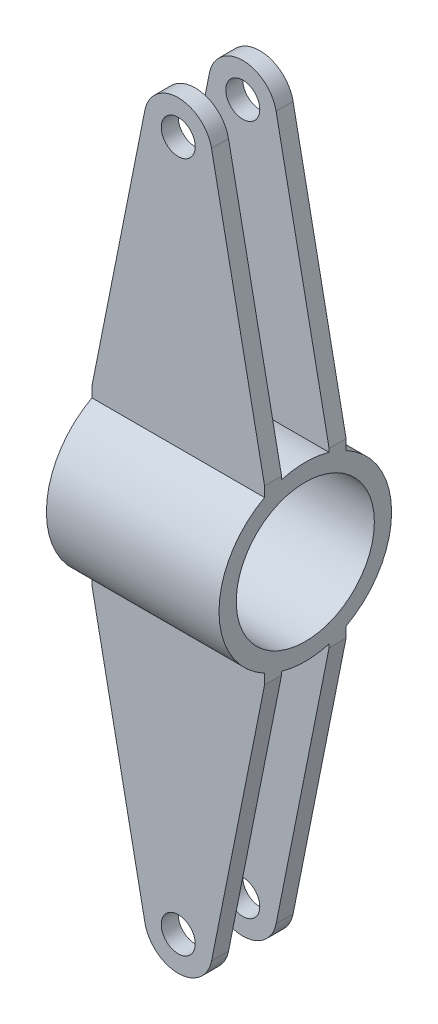
ISO-10303-21;
HEADER;
FILE_DESCRIPTION(('STEP AP214'),'2;1');
FILE_NAME('part.step','',(''),(''),'','','');
FILE_SCHEMA(('AUTOMOTIVE_DESIGN { 1 0 10303 214 1 1 1 1 }'));
ENDSEC;
DATA;
#1=APPLICATION_CONTEXT('core data for automotive mechanical design processes');
#2=APPLICATION_PROTOCOL_DEFINITION('international standard','automotive_design',2000,#1);
#3=PRODUCT_CONTEXT('',#1,'mechanical');
#4=PRODUCT('Part','Part','',(#3));
#5=PRODUCT_RELATED_PRODUCT_CATEGORY('part','',(#4));
#6=PRODUCT_DEFINITION_FORMATION('','',#4);
#7=PRODUCT_DEFINITION_CONTEXT('part definition',#1,'design');
#8=PRODUCT_DEFINITION('design','',#6,#7);
#9=PRODUCT_DEFINITION_SHAPE('','',#8);
#10=(LENGTH_UNIT() NAMED_UNIT(*) SI_UNIT(.MILLI.,.METRE.));
#11=(NAMED_UNIT(*) PLANE_ANGLE_UNIT() SI_UNIT($,.RADIAN.));
#12=(NAMED_UNIT(*) SI_UNIT($,.STERADIAN.) SOLID_ANGLE_UNIT());
#13=UNCERTAINTY_MEASURE_WITH_UNIT(LENGTH_MEASURE(1.E-05),#10,'distance_accuracy_value','');
#14=(GEOMETRIC_REPRESENTATION_CONTEXT(3) GLOBAL_UNCERTAINTY_ASSIGNED_CONTEXT((#13)) GLOBAL_UNIT_ASSIGNED_CONTEXT((#10,
#11,#12)) REPRESENTATION_CONTEXT('',''));
#15=CARTESIAN_POINT('',(0.,0.,0.));
#16=DIRECTION('',(0.,0.,1.));
#17=DIRECTION('',(1.,0.,0.));
#18=AXIS2_PLACEMENT_3D('',#15,#16,#17);
#19=CARTESIAN_POINT('',(25.4,0.,0.));
#20=DIRECTION('',(-1.,0.,0.));
#21=DIRECTION('',(0.,0.,1.));
#22=AXIS2_PLACEMENT_3D('',#19,#20,#21);
#23=CYLINDRICAL_SURFACE('',#22,25.4);
#24=DIRECTION('',(-1.,0.,0.));
#25=VECTOR('',#24,1.);
#26=CARTESIAN_POINT('',(25.4,22.3866031366976,12.));
#27=LINE('',#26,#25);
#28=CARTESIAN_POINT('',(25.4,22.3866031366976,12.));
#29=VERTEX_POINT('',#28);
#30=CARTESIAN_POINT('',(-25.4,22.3866031366976,12.));
#31=VERTEX_POINT('',#30);
#32=EDGE_CURVE('E269',#29,#31,#27,.T.);
#33=ORIENTED_EDGE('',*,*,#32,.T.);
#34=CARTESIAN_POINT('',(-25.4,0.,0.));
#35=DIRECTION('',(1.,0.,0.));
#36=DIRECTION('',(0.,0.,-1.));
#37=AXIS2_PLACEMENT_3D('',#34,#35,#36);
#38=CIRCLE('',#37,25.4);
#39=CARTESIAN_POINT('',(-25.4,-22.3866031366976,12.));
#40=VERTEX_POINT('',#39);
#41=EDGE_CURVE('E538',#31,#40,#38,.T.);
#42=ORIENTED_EDGE('',*,*,#41,.T.);
#43=DIRECTION('',(-1.,0.,0.));
#44=VECTOR('',#43,1.);
#45=CARTESIAN_POINT('',(25.4,-22.3866031366976,12.));
#46=LINE('',#45,#44);
#47=CARTESIAN_POINT('',(25.4,-22.3866031366976,12.));
#48=VERTEX_POINT('',#47);
#49=EDGE_CURVE('E320',#48,#40,#46,.T.);
#50=ORIENTED_EDGE('',*,*,#49,.F.);
#51=CARTESIAN_POINT('',(25.4,0.,0.));
#52=DIRECTION('',(1.,0.,0.));
#53=DIRECTION('',(0.,0.,-1.));
#54=AXIS2_PLACEMENT_3D('',#51,#52,#53);
#55=CIRCLE('',#54,25.4);
#56=EDGE_CURVE('E49',#29,#48,#55,.T.);
#57=ORIENTED_EDGE('',*,*,#56,.F.);
#58=EDGE_LOOP('',(#33,#42,#50,#57));
#59=FACE_BOUND('',#58,.T.);
#60=ADVANCED_FACE('F39',(#59),#23,.T.);
#61=DIRECTION('',(-1.,0.,0.));
#62=VECTOR('',#61,1.);
#63=CARTESIAN_POINT('',(25.4,24.416387939251,7.));
#64=LINE('',#63,#62);
#65=CARTESIAN_POINT('',(25.4,24.416387939251,7.));
#66=VERTEX_POINT('',#65);
#67=CARTESIAN_POINT('',(-25.4,24.416387939251,7.));
#68=VERTEX_POINT('',#67);
#69=EDGE_CURVE('E64',#66,#68,#64,.T.);
#70=ORIENTED_EDGE('',*,*,#69,.F.);
#71=CARTESIAN_POINT('',(25.4,24.416387939251,-7.));
#72=VERTEX_POINT('',#71);
#73=EDGE_CURVE('E11',#72,#66,#55,.T.);
#74=ORIENTED_EDGE('',*,*,#73,.F.);
#75=DIRECTION('',(-1.,0.,0.));
#76=VECTOR('',#75,1.);
#77=CARTESIAN_POINT('',(25.4,24.416387939251,-7.));
#78=LINE('',#77,#76);
#79=CARTESIAN_POINT('',(-25.4,24.416387939251,-7.));
#80=VERTEX_POINT('',#79);
#81=EDGE_CURVE('E469',#72,#80,#78,.T.);
#82=ORIENTED_EDGE('',*,*,#81,.T.);
#83=EDGE_CURVE('E43',#80,#68,#38,.T.);
#84=ORIENTED_EDGE('',*,*,#83,.T.);
#85=EDGE_LOOP('',(#70,#74,#82,#84));
#86=FACE_BOUND('',#85,.T.);
#87=ADVANCED_FACE('F501',(#86),#23,.T.);
#88=DIRECTION('',(-1.,0.,0.));
#89=VECTOR('',#88,1.);
#90=CARTESIAN_POINT('',(25.4,-24.416387939251,7.));
#91=LINE('',#90,#89);
#92=CARTESIAN_POINT('',(25.4,-24.416387939251,7.));
#93=VERTEX_POINT('',#92);
#94=CARTESIAN_POINT('',(-25.4,-24.416387939251,7.));
#95=VERTEX_POINT('',#94);
#96=EDGE_CURVE('E333',#93,#95,#91,.T.);
#97=ORIENTED_EDGE('',*,*,#96,.T.);
#98=CARTESIAN_POINT('',(-25.4,-24.416387939251,-7.));
#99=VERTEX_POINT('',#98);
#100=EDGE_CURVE('E535',#95,#99,#38,.T.);
#101=ORIENTED_EDGE('',*,*,#100,.T.);
#102=DIRECTION('',(-1.,0.,0.));
#103=VECTOR('',#102,1.);
#104=CARTESIAN_POINT('',(25.4,-24.416387939251,-7.));
#105=LINE('',#104,#103);
#106=CARTESIAN_POINT('',(25.4,-24.416387939251,-7.));
#107=VERTEX_POINT('',#106);
#108=EDGE_CURVE('E387',#107,#99,#105,.T.);
#109=ORIENTED_EDGE('',*,*,#108,.F.);
#110=EDGE_CURVE('E540',#93,#107,#55,.T.);
#111=ORIENTED_EDGE('',*,*,#110,.F.);
#112=EDGE_LOOP('',(#97,#101,#109,#111));
#113=FACE_BOUND('',#112,.T.);
#114=ADVANCED_FACE('F505',(#113),#23,.T.);
#115=DIRECTION('',(-1.,0.,0.));
#116=VECTOR('',#115,1.);
#117=CARTESIAN_POINT('',(25.4,-22.3866031366976,-12.));
#118=LINE('',#117,#116);
#119=CARTESIAN_POINT('',(25.4,-22.3866031366976,-12.));
#120=VERTEX_POINT('',#119);
#121=CARTESIAN_POINT('',(-25.4,-22.3866031366976,-12.));
#122=VERTEX_POINT('',#121);
#123=EDGE_CURVE('E401',#120,#122,#118,.T.);
#124=ORIENTED_EDGE('',*,*,#123,.T.);
#125=CARTESIAN_POINT('',(-25.4,22.3866031366976,-12.));
#126=VERTEX_POINT('',#125);
#127=EDGE_CURVE('E478',#122,#126,#38,.T.);
#128=ORIENTED_EDGE('',*,*,#127,.T.);
#129=DIRECTION('',(-1.,0.,0.));
#130=VECTOR('',#129,1.);
#131=CARTESIAN_POINT('',(25.4,22.3866031366976,-12.));
#132=LINE('',#131,#130);
#133=CARTESIAN_POINT('',(25.4,22.3866031366976,-12.));
#134=VERTEX_POINT('',#133);
#135=EDGE_CURVE('E455',#134,#126,#132,.T.);
#136=ORIENTED_EDGE('',*,*,#135,.F.);
#137=EDGE_CURVE('E50',#120,#134,#55,.T.);
#138=ORIENTED_EDGE('',*,*,#137,.F.);
#139=EDGE_LOOP('',(#124,#128,#136,#138));
#140=FACE_BOUND('',#139,.T.);
#141=ADVANCED_FACE('F41',(#140),#23,.T.);
#142=CARTESIAN_POINT('',(25.4,0.,0.));
#143=DIRECTION('',(1.,0.,0.));
#144=DIRECTION('',(0.,0.,-1.));
#145=AXIS2_PLACEMENT_3D('',#142,#143,#144);
#146=PLANE('',#145);
#147=ORIENTED_EDGE('',*,*,#73,.T.);
#148=DIRECTION('',(0.,1.,0.));
#149=VECTOR('',#148,1.);
#150=CARTESIAN_POINT('',(25.4,25.4,7.));
#151=LINE('',#150,#149);
#152=CARTESIAN_POINT('',(25.4,25.4,7.));
#153=VERTEX_POINT('',#152);
#154=EDGE_CURVE('E252',#66,#153,#151,.T.);
#155=ORIENTED_EDGE('',*,*,#154,.T.);
#156=DIRECTION('',(0.,0.,1.));
#157=VECTOR('',#156,1.);
#158=CARTESIAN_POINT('',(25.4,25.4,12.));
#159=LINE('',#158,#157);
#160=CARTESIAN_POINT('',(25.4,25.4,12.));
#161=VERTEX_POINT('',#160);
#162=EDGE_CURVE('E256',#153,#161,#159,.T.);
#163=ORIENTED_EDGE('',*,*,#162,.T.);
#164=DIRECTION('',(0.,-1.,0.));
#165=VECTOR('',#164,1.);
#166=CARTESIAN_POINT('',(25.4,25.4,12.));
#167=LINE('',#166,#165);
#168=EDGE_CURVE('E212',#161,#29,#167,.T.);
#169=ORIENTED_EDGE('',*,*,#168,.T.);
#170=ORIENTED_EDGE('',*,*,#56,.T.);
#171=DIRECTION('',(0.,-1.,0.));
#172=VECTOR('',#171,1.);
#173=CARTESIAN_POINT('',(25.4,-25.4,12.));
#174=LINE('',#173,#172);
#175=CARTESIAN_POINT('',(25.4,-25.4,12.));
#176=VERTEX_POINT('',#175);
#177=EDGE_CURVE('E307',#48,#176,#174,.T.);
#178=ORIENTED_EDGE('',*,*,#177,.T.);
#179=DIRECTION('',(0.,0.,-1.));
#180=VECTOR('',#179,1.);
#181=CARTESIAN_POINT('',(25.4,-25.4,12.));
#182=LINE('',#181,#180);
#183=CARTESIAN_POINT('',(25.4,-25.4,7.));
#184=VERTEX_POINT('',#183);
#185=EDGE_CURVE('E311',#176,#184,#182,.T.);
#186=ORIENTED_EDGE('',*,*,#185,.T.);
#187=DIRECTION('',(0.,1.,0.));
#188=VECTOR('',#187,1.);
#189=CARTESIAN_POINT('',(25.4,-25.4,7.));
#190=LINE('',#189,#188);
#191=EDGE_CURVE('E316',#184,#93,#190,.T.);
#192=ORIENTED_EDGE('',*,*,#191,.T.);
#193=ORIENTED_EDGE('',*,*,#110,.T.);
#194=DIRECTION('',(0.,-1.,0.));
#195=VECTOR('',#194,1.);
#196=CARTESIAN_POINT('',(25.4,-25.4,-7.));
#197=LINE('',#196,#195);
#198=CARTESIAN_POINT('',(25.4,-25.4,-7.));
#199=VERTEX_POINT('',#198);
#200=EDGE_CURVE('E380',#107,#199,#197,.T.);
#201=ORIENTED_EDGE('',*,*,#200,.T.);
#202=DIRECTION('',(0.,0.,-1.));
#203=VECTOR('',#202,1.);
#204=CARTESIAN_POINT('',(25.4,-25.4,-12.));
#205=LINE('',#204,#203);
#206=CARTESIAN_POINT('',(25.4,-25.4,-12.));
#207=VERTEX_POINT('',#206);
#208=EDGE_CURVE('E384',#199,#207,#205,.T.);
#209=ORIENTED_EDGE('',*,*,#208,.T.);
#210=DIRECTION('',(0.,1.,0.));
#211=VECTOR('',#210,1.);
#212=CARTESIAN_POINT('',(25.4,-25.4,-12.));
#213=LINE('',#212,#211);
#214=EDGE_CURVE('E376',#207,#120,#213,.T.);
#215=ORIENTED_EDGE('',*,*,#214,.T.);
#216=ORIENTED_EDGE('',*,*,#137,.T.);
#217=DIRECTION('',(0.,1.,0.));
#218=VECTOR('',#217,1.);
#219=CARTESIAN_POINT('',(25.4,25.4,-12.));
#220=LINE('',#219,#218);
#221=CARTESIAN_POINT('',(25.4,25.4,-12.));
#222=VERTEX_POINT('',#221);
#223=EDGE_CURVE('E442',#134,#222,#220,.T.);
#224=ORIENTED_EDGE('',*,*,#223,.T.);
#225=DIRECTION('',(0.,0.,1.));
#226=VECTOR('',#225,1.);
#227=CARTESIAN_POINT('',(25.4,25.4,-12.));
#228=LINE('',#227,#226);
#229=CARTESIAN_POINT('',(25.4,25.4,-7.));
#230=VERTEX_POINT('',#229);
#231=EDGE_CURVE('E446',#222,#230,#228,.T.);
#232=ORIENTED_EDGE('',*,*,#231,.T.);
#233=DIRECTION('',(0.,-1.,0.));
#234=VECTOR('',#233,1.);
#235=CARTESIAN_POINT('',(25.4,25.4,-7.));
#236=LINE('',#235,#234);
#237=EDGE_CURVE('E451',#230,#72,#236,.T.);
#238=ORIENTED_EDGE('',*,*,#237,.T.);
#239=EDGE_LOOP('',(#147,#155,#163,#169,#170,#178,#186,#192,#193,#201,#209,#215,#216,#224,#232,#238));
#240=FACE_BOUND('',#239,.T.);
#241=CARTESIAN_POINT('',(25.4,0.,0.));
#242=DIRECTION('',(1.,0.,0.));
#243=DIRECTION('',(0.,0.,-1.));
#244=AXIS2_PLACEMENT_3D('',#241,#242,#243);
#245=CIRCLE('',#244,20.32);
#246=CARTESIAN_POINT('',(25.4,0.,-20.32));
#247=VERTEX_POINT('',#246);
#248=EDGE_CURVE('E474',#247,#247,#245,.T.);
#249=ORIENTED_EDGE('',*,*,#248,.F.);
#250=EDGE_LOOP('',(#249));
#251=FACE_BOUND('',#250,.T.);
#252=ADVANCED_FACE('F497',(#240,#251),#146,.T.);
#253=CARTESIAN_POINT('',(-25.4,0.,0.));
#254=DIRECTION('',(1.,0.,0.));
#255=DIRECTION('',(0.,0.,-1.));
#256=AXIS2_PLACEMENT_3D('',#253,#254,#255);
#257=PLANE('',#256);
#258=ORIENTED_EDGE('',*,*,#83,.F.);
#259=DIRECTION('',(0.,-1.,0.));
#260=VECTOR('',#259,1.);
#261=CARTESIAN_POINT('',(-25.4,25.4,-7.));
#262=LINE('',#261,#260);
#263=CARTESIAN_POINT('',(-25.4,25.4,-7.));
#264=VERTEX_POINT('',#263);
#265=EDGE_CURVE('E447',#264,#80,#262,.T.);
#266=ORIENTED_EDGE('',*,*,#265,.F.);
#267=DIRECTION('',(0.,0.,1.));
#268=VECTOR('',#267,1.);
#269=CARTESIAN_POINT('',(-25.4,25.4,-12.));
#270=LINE('',#269,#268);
#271=CARTESIAN_POINT('',(-25.4,25.4,-12.));
#272=VERTEX_POINT('',#271);
#273=EDGE_CURVE('E459',#272,#264,#270,.T.);
#274=ORIENTED_EDGE('',*,*,#273,.F.);
#275=DIRECTION('',(0.,1.,0.));
#276=VECTOR('',#275,1.);
#277=CARTESIAN_POINT('',(-25.4,25.4,-12.));
#278=LINE('',#277,#276);
#279=EDGE_CURVE('E439',#126,#272,#278,.T.);
#280=ORIENTED_EDGE('',*,*,#279,.F.);
#281=ORIENTED_EDGE('',*,*,#127,.F.);
#282=DIRECTION('',(0.,1.,0.));
#283=VECTOR('',#282,1.);
#284=CARTESIAN_POINT('',(-25.4,-25.4,-12.));
#285=LINE('',#284,#283);
#286=CARTESIAN_POINT('',(-25.4,-25.4,-12.));
#287=VERTEX_POINT('',#286);
#288=EDGE_CURVE('E373',#287,#122,#285,.T.);
#289=ORIENTED_EDGE('',*,*,#288,.F.);
#290=DIRECTION('',(0.,0.,-1.));
#291=VECTOR('',#290,1.);
#292=CARTESIAN_POINT('',(-25.4,-25.4,-12.));
#293=LINE('',#292,#291);
#294=CARTESIAN_POINT('',(-25.4,-25.4,-7.));
#295=VERTEX_POINT('',#294);
#296=EDGE_CURVE('E381',#295,#287,#293,.T.);
#297=ORIENTED_EDGE('',*,*,#296,.F.);
#298=DIRECTION('',(0.,-1.,0.));
#299=VECTOR('',#298,1.);
#300=CARTESIAN_POINT('',(-25.4,-25.4,-7.));
#301=LINE('',#300,#299);
#302=EDGE_CURVE('E391',#99,#295,#301,.T.);
#303=ORIENTED_EDGE('',*,*,#302,.F.);
#304=ORIENTED_EDGE('',*,*,#100,.F.);
#305=DIRECTION('',(0.,1.,0.));
#306=VECTOR('',#305,1.);
#307=CARTESIAN_POINT('',(-25.4,-25.4,7.));
#308=LINE('',#307,#306);
#309=CARTESIAN_POINT('',(-25.4,-25.4,7.));
#310=VERTEX_POINT('',#309);
#311=EDGE_CURVE('E312',#310,#95,#308,.T.);
#312=ORIENTED_EDGE('',*,*,#311,.F.);
#313=DIRECTION('',(0.,0.,-1.));
#314=VECTOR('',#313,1.);
#315=CARTESIAN_POINT('',(-25.4,-25.4,12.));
#316=LINE('',#315,#314);
#317=CARTESIAN_POINT('',(-25.4,-25.4,12.));
#318=VERTEX_POINT('',#317);
#319=EDGE_CURVE('E324',#318,#310,#316,.T.);
#320=ORIENTED_EDGE('',*,*,#319,.F.);
#321=DIRECTION('',(0.,-1.,0.));
#322=VECTOR('',#321,1.);
#323=CARTESIAN_POINT('',(-25.4,-25.4,12.));
#324=LINE('',#323,#322);
#325=EDGE_CURVE('E306',#40,#318,#324,.T.);
#326=ORIENTED_EDGE('',*,*,#325,.F.);
#327=ORIENTED_EDGE('',*,*,#41,.F.);
#328=DIRECTION('',(0.,-1.,0.));
#329=VECTOR('',#328,1.);
#330=CARTESIAN_POINT('',(-25.4,25.4,12.));
#331=LINE('',#330,#329);
#332=CARTESIAN_POINT('',(-25.4,25.4,12.));
#333=VERTEX_POINT('',#332);
#334=EDGE_CURVE('E226',#333,#31,#331,.T.);
#335=ORIENTED_EDGE('',*,*,#334,.F.);
#336=DIRECTION('',(0.,0.,1.));
#337=VECTOR('',#336,1.);
#338=CARTESIAN_POINT('',(-25.4,25.4,12.));
#339=LINE('',#338,#337);
#340=CARTESIAN_POINT('',(-25.4,25.4,7.));
#341=VERTEX_POINT('',#340);
#342=EDGE_CURVE('E253',#341,#333,#339,.T.);
#343=ORIENTED_EDGE('',*,*,#342,.F.);
#344=DIRECTION('',(0.,1.,0.));
#345=VECTOR('',#344,1.);
#346=CARTESIAN_POINT('',(-25.4,25.4,7.));
#347=LINE('',#346,#345);
#348=EDGE_CURVE('E261',#68,#341,#347,.T.);
#349=ORIENTED_EDGE('',*,*,#348,.F.);
#350=EDGE_LOOP('',(#258,#266,#274,#280,#281,#289,#297,#303,#304,#312,#320,#326,#327,#335,#343,#349));
#351=FACE_BOUND('',#350,.T.);
#352=CARTESIAN_POINT('',(-25.4,0.,0.));
#353=DIRECTION('',(1.,0.,0.));
#354=DIRECTION('',(0.,0.,-1.));
#355=AXIS2_PLACEMENT_3D('',#352,#353,#354);
#356=CIRCLE('',#355,20.32);
#357=CARTESIAN_POINT('',(-25.4,0.,-20.32));
#358=VERTEX_POINT('',#357);
#359=EDGE_CURVE('E473',#358,#358,#356,.T.);
#360=ORIENTED_EDGE('',*,*,#359,.T.);
#361=EDGE_LOOP('',(#360));
#362=FACE_BOUND('',#361,.T.);
#363=ADVANCED_FACE('F483',(#351,#362),#257,.F.);
#364=CARTESIAN_POINT('',(25.4,0.,0.));
#365=DIRECTION('',(-1.,0.,0.));
#366=DIRECTION('',(0.,0.,1.));
#367=AXIS2_PLACEMENT_3D('',#364,#365,#366);
#368=CYLINDRICAL_SURFACE('',#367,20.32);
#369=ORIENTED_EDGE('',*,*,#248,.T.);
#370=EDGE_LOOP('',(#369));
#371=FACE_BOUND('',#370,.T.);
#372=ORIENTED_EDGE('',*,*,#359,.F.);
#373=EDGE_LOOP('',(#372));
#374=FACE_BOUND('',#373,.T.);
#375=ADVANCED_FACE('F485',(#371,#374),#368,.F.);
#376=CARTESIAN_POINT('',(25.4,25.4,-12.));
#377=DIRECTION('',(0.,0.,1.));
#378=DIRECTION('',(1.,0.,0.));
#379=AXIS2_PLACEMENT_3D('',#376,#377,#378);
#380=PLANE('',#379);
#381=ORIENTED_EDGE('',*,*,#279,.T.);
#382=DIRECTION('',(-0.195657188634298,-0.980672353304468,0.));
#383=VECTOR('',#382,1.);
#384=CARTESIAN_POINT('',(-25.4,25.4,-12.));
#385=LINE('',#384,#383);
#386=CARTESIAN_POINT('',(-9.80672353304468,103.556571886343,-12.));
#387=VERTEX_POINT('',#386);
#388=EDGE_CURVE('E423',#387,#272,#385,.T.);
#389=ORIENTED_EDGE('',*,*,#388,.F.);
#390=CARTESIAN_POINT('',(0.,101.6,-12.));
#391=DIRECTION('',(0.,0.,1.));
#392=DIRECTION('',(1.,0.,0.));
#393=AXIS2_PLACEMENT_3D('',#390,#391,#392);
#394=CIRCLE('',#393,10.);
#395=CARTESIAN_POINT('',(9.80672353304468,103.556571886343,-12.));
#396=VERTEX_POINT('',#395);
#397=EDGE_CURVE('E418',#396,#387,#394,.T.);
#398=ORIENTED_EDGE('',*,*,#397,.F.);
#399=DIRECTION('',(-0.195657188634298,0.980672353304468,0.));
#400=VECTOR('',#399,1.);
#401=CARTESIAN_POINT('',(25.4,25.4,-12.));
#402=LINE('',#401,#400);
#403=EDGE_CURVE('E414',#222,#396,#402,.T.);
#404=ORIENTED_EDGE('',*,*,#403,.F.);
#405=ORIENTED_EDGE('',*,*,#223,.F.);
#406=ORIENTED_EDGE('',*,*,#135,.T.);
#407=EDGE_LOOP('',(#381,#389,#398,#404,#405,#406));
#408=FACE_BOUND('',#407,.T.);
#409=CARTESIAN_POINT('',(0.,101.6,-12.));
#410=DIRECTION('',(0.,0.,1.));
#411=DIRECTION('',(1.,0.,0.));
#412=AXIS2_PLACEMENT_3D('',#409,#410,#411);
#413=CIRCLE('',#412,5.);
#414=CARTESIAN_POINT('',(5.,101.6,-12.));
#415=VERTEX_POINT('',#414);
#416=EDGE_CURVE('E406',#415,#415,#413,.T.);
#417=ORIENTED_EDGE('',*,*,#416,.T.);
#418=EDGE_LOOP('',(#417));
#419=FACE_BOUND('',#418,.T.);
#420=ADVANCED_FACE('F487',(#408,#419),#380,.F.);
#421=CARTESIAN_POINT('',(25.4,25.4,-7.));
#422=DIRECTION('',(0.,0.,-1.));
#423=DIRECTION('',(-1.,0.,0.));
#424=AXIS2_PLACEMENT_3D('',#421,#422,#423);
#425=PLANE('',#424);
#426=ORIENTED_EDGE('',*,*,#265,.T.);
#427=ORIENTED_EDGE('',*,*,#81,.F.);
#428=ORIENTED_EDGE('',*,*,#237,.F.);
#429=DIRECTION('',(-0.195657188634298,0.980672353304468,0.));
#430=VECTOR('',#429,1.);
#431=CARTESIAN_POINT('',(25.4,25.4,-7.));
#432=LINE('',#431,#430);
#433=CARTESIAN_POINT('',(9.80672353304468,103.556571886343,-7.));
#434=VERTEX_POINT('',#433);
#435=EDGE_CURVE('E410',#230,#434,#432,.T.);
#436=ORIENTED_EDGE('',*,*,#435,.T.);
#437=CARTESIAN_POINT('',(0.,101.6,-7.));
#438=DIRECTION('',(0.,0.,1.));
#439=DIRECTION('',(1.,0.,0.));
#440=AXIS2_PLACEMENT_3D('',#437,#438,#439);
#441=CIRCLE('',#440,10.);
#442=CARTESIAN_POINT('',(-9.80672353304468,103.556571886343,-7.));
#443=VERTEX_POINT('',#442);
#444=EDGE_CURVE('E430',#434,#443,#441,.T.);
#445=ORIENTED_EDGE('',*,*,#444,.T.);
#446=DIRECTION('',(-0.195657188634298,-0.980672353304468,0.));
#447=VECTOR('',#446,1.);
#448=CARTESIAN_POINT('',(-25.4,25.4,-7.));
#449=LINE('',#448,#447);
#450=EDGE_CURVE('E419',#443,#264,#449,.T.);
#451=ORIENTED_EDGE('',*,*,#450,.T.);
#452=EDGE_LOOP('',(#426,#427,#428,#436,#445,#451));
#453=FACE_BOUND('',#452,.T.);
#454=CARTESIAN_POINT('',(0.,101.6,-7.));
#455=DIRECTION('',(0.,0.,1.));
#456=DIRECTION('',(1.,0.,0.));
#457=AXIS2_PLACEMENT_3D('',#454,#455,#456);
#458=CIRCLE('',#457,5.);
#459=CARTESIAN_POINT('',(5.,101.6,-7.));
#460=VERTEX_POINT('',#459);
#461=EDGE_CURVE('E405',#460,#460,#458,.T.);
#462=ORIENTED_EDGE('',*,*,#461,.F.);
#463=EDGE_LOOP('',(#462));
#464=FACE_BOUND('',#463,.T.);
#465=ADVANCED_FACE('F494',(#453,#464),#425,.F.);
#466=CARTESIAN_POINT('',(-25.4,25.4,-12.));
#467=DIRECTION('',(-0.980672353304468,0.195657188634298,0.));
#468=DIRECTION('',(-0.195657188634298,-0.980672353304468,0.));
#469=AXIS2_PLACEMENT_3D('',#466,#467,#468);
#470=PLANE('',#469);
#471=ORIENTED_EDGE('',*,*,#450,.F.);
#472=DIRECTION('',(0.,0.,1.));
#473=VECTOR('',#472,1.);
#474=CARTESIAN_POINT('',(-9.80672353304468,103.556571886343,-12.));
#475=LINE('',#474,#473);
#476=EDGE_CURVE('E436',#387,#443,#475,.T.);
#477=ORIENTED_EDGE('',*,*,#476,.F.);
#478=ORIENTED_EDGE('',*,*,#388,.T.);
#479=ORIENTED_EDGE('',*,*,#273,.T.);
#480=EDGE_LOOP('',(#471,#477,#478,#479));
#481=FACE_BOUND('',#480,.T.);
#482=ADVANCED_FACE('F634',(#481),#470,.T.);
#483=CARTESIAN_POINT('',(0.,101.6,-12.));
#484=DIRECTION('',(0.,0.,1.));
#485=DIRECTION('',(1.,0.,0.));
#486=AXIS2_PLACEMENT_3D('',#483,#484,#485);
#487=CYLINDRICAL_SURFACE('',#486,10.);
#488=ORIENTED_EDGE('',*,*,#444,.F.);
#489=DIRECTION('',(0.,0.,1.));
#490=VECTOR('',#489,1.);
#491=CARTESIAN_POINT('',(9.80672353304468,103.556571886343,-12.));
#492=LINE('',#491,#490);
#493=EDGE_CURVE('E426',#396,#434,#492,.T.);
#494=ORIENTED_EDGE('',*,*,#493,.F.);
#495=ORIENTED_EDGE('',*,*,#397,.T.);
#496=ORIENTED_EDGE('',*,*,#476,.T.);
#497=EDGE_LOOP('',(#488,#494,#495,#496));
#498=FACE_BOUND('',#497,.T.);
#499=ADVANCED_FACE('F637',(#498),#487,.T.);
#500=CARTESIAN_POINT('',(25.4,25.4,-12.));
#501=DIRECTION('',(0.980672353304468,0.195657188634298,0.));
#502=DIRECTION('',(-0.195657188634298,0.980672353304468,0.));
#503=AXIS2_PLACEMENT_3D('',#500,#501,#502);
#504=PLANE('',#503);
#505=ORIENTED_EDGE('',*,*,#435,.F.);
#506=ORIENTED_EDGE('',*,*,#231,.F.);
#507=ORIENTED_EDGE('',*,*,#403,.T.);
#508=ORIENTED_EDGE('',*,*,#493,.T.);
#509=EDGE_LOOP('',(#505,#506,#507,#508));
#510=FACE_BOUND('',#509,.T.);
#511=ADVANCED_FACE('F632',(#510),#504,.T.);
#512=CARTESIAN_POINT('',(0.,101.6,-12.));
#513=DIRECTION('',(0.,0.,1.));
#514=DIRECTION('',(1.,0.,0.));
#515=AXIS2_PLACEMENT_3D('',#512,#513,#514);
#516=CYLINDRICAL_SURFACE('',#515,5.);
#517=ORIENTED_EDGE('',*,*,#416,.F.);
#518=EDGE_LOOP('',(#517));
#519=FACE_BOUND('',#518,.T.);
#520=ORIENTED_EDGE('',*,*,#461,.T.);
#521=EDGE_LOOP('',(#520));
#522=FACE_BOUND('',#521,.T.);
#523=ADVANCED_FACE('F629',(#519,#522),#516,.F.);
#524=CARTESIAN_POINT('',(25.4,-25.4,-12.));
#525=DIRECTION('',(0.,0.,1.));
#526=DIRECTION('',(1.,0.,0.));
#527=AXIS2_PLACEMENT_3D('',#524,#525,#526);
#528=PLANE('',#527);
#529=ORIENTED_EDGE('',*,*,#288,.T.);
#530=ORIENTED_EDGE('',*,*,#123,.F.);
#531=ORIENTED_EDGE('',*,*,#214,.F.);
#532=DIRECTION('',(0.195657188634298,0.980672353304468,0.));
#533=VECTOR('',#532,1.);
#534=CARTESIAN_POINT('',(9.80672353304468,-103.556571886343,-12.));
#535=LINE('',#534,#533);
#536=CARTESIAN_POINT('',(9.80672353304468,-103.556571886343,-12.));
#537=VERTEX_POINT('',#536);
#538=EDGE_CURVE('E355',#537,#207,#535,.T.);
#539=ORIENTED_EDGE('',*,*,#538,.F.);
#540=CARTESIAN_POINT('',(0.,-101.6,-12.));
#541=DIRECTION('',(0.,0.,1.));
#542=DIRECTION('',(1.,0.,0.));
#543=AXIS2_PLACEMENT_3D('',#540,#541,#542);
#544=CIRCLE('',#543,10.);
#545=CARTESIAN_POINT('',(-9.80672353304468,-103.556571886343,-12.));
#546=VERTEX_POINT('',#545);
#547=EDGE_CURVE('E350',#546,#537,#544,.T.);
#548=ORIENTED_EDGE('',*,*,#547,.F.);
#549=DIRECTION('',(0.195657188634298,-0.980672353304468,0.));
#550=VECTOR('',#549,1.);
#551=CARTESIAN_POINT('',(-25.4,-25.4,-12.));
#552=LINE('',#551,#550);
#553=EDGE_CURVE('E346',#287,#546,#552,.T.);
#554=ORIENTED_EDGE('',*,*,#553,.F.);
#555=EDGE_LOOP('',(#529,#530,#531,#539,#548,#554));
#556=FACE_BOUND('',#555,.T.);
#557=CARTESIAN_POINT('',(0.,-101.6,-12.));
#558=DIRECTION('',(0.,0.,1.));
#559=DIRECTION('',(1.,0.,0.));
#560=AXIS2_PLACEMENT_3D('',#557,#558,#559);
#561=CIRCLE('',#560,5.);
#562=CARTESIAN_POINT('',(5.,-101.6,-12.));
#563=VERTEX_POINT('',#562);
#564=EDGE_CURVE('E338',#563,#563,#561,.T.);
#565=ORIENTED_EDGE('',*,*,#564,.T.);
#566=EDGE_LOOP('',(#565));
#567=FACE_BOUND('',#566,.T.);
#568=ADVANCED_FACE('F519',(#556,#567),#528,.F.);
#569=CARTESIAN_POINT('',(25.4,-25.4,-7.));
#570=DIRECTION('',(0.,0.,-1.));
#571=DIRECTION('',(-1.,0.,0.));
#572=AXIS2_PLACEMENT_3D('',#569,#570,#571);
#573=PLANE('',#572);
#574=ORIENTED_EDGE('',*,*,#302,.T.);
#575=DIRECTION('',(0.195657188634298,-0.980672353304468,0.));
#576=VECTOR('',#575,1.);
#577=CARTESIAN_POINT('',(-25.4,-25.4,-7.));
#578=LINE('',#577,#576);
#579=CARTESIAN_POINT('',(-9.80672353304468,-103.556571886343,-7.));
#580=VERTEX_POINT('',#579);
#581=EDGE_CURVE('E342',#295,#580,#578,.T.);
#582=ORIENTED_EDGE('',*,*,#581,.T.);
#583=CARTESIAN_POINT('',(0.,-101.6,-7.));
#584=DIRECTION('',(0.,0.,1.));
#585=DIRECTION('',(1.,0.,0.));
#586=AXIS2_PLACEMENT_3D('',#583,#584,#585);
#587=CIRCLE('',#586,10.);
#588=CARTESIAN_POINT('',(9.80672353304468,-103.556571886343,-7.));
#589=VERTEX_POINT('',#588);
#590=EDGE_CURVE('E363',#580,#589,#587,.T.);
#591=ORIENTED_EDGE('',*,*,#590,.T.);
#592=DIRECTION('',(0.195657188634298,0.980672353304468,0.));
#593=VECTOR('',#592,1.);
#594=CARTESIAN_POINT('',(9.80672353304468,-103.556571886343,-7.));
#595=LINE('',#594,#593);
#596=EDGE_CURVE('E351',#589,#199,#595,.T.);
#597=ORIENTED_EDGE('',*,*,#596,.T.);
#598=ORIENTED_EDGE('',*,*,#200,.F.);
#599=ORIENTED_EDGE('',*,*,#108,.T.);
#600=EDGE_LOOP('',(#574,#582,#591,#597,#598,#599));
#601=FACE_BOUND('',#600,.T.);
#602=CARTESIAN_POINT('',(0.,-101.6,-7.));
#603=DIRECTION('',(0.,0.,1.));
#604=DIRECTION('',(1.,0.,0.));
#605=AXIS2_PLACEMENT_3D('',#602,#603,#604);
#606=CIRCLE('',#605,5.);
#607=CARTESIAN_POINT('',(5.,-101.6,-7.));
#608=VERTEX_POINT('',#607);
#609=EDGE_CURVE('E337',#608,#608,#606,.T.);
#610=ORIENTED_EDGE('',*,*,#609,.F.);
#611=EDGE_LOOP('',(#610));
#612=FACE_BOUND('',#611,.T.);
#613=ADVANCED_FACE('F529',(#601,#612),#573,.F.);
#614=CARTESIAN_POINT('',(9.80672353304468,-103.556571886343,-12.));
#615=DIRECTION('',(0.980672353304468,-0.195657188634298,0.));
#616=DIRECTION('',(0.195657188634298,0.980672353304468,0.));
#617=AXIS2_PLACEMENT_3D('',#614,#615,#616);
#618=PLANE('',#617);
#619=ORIENTED_EDGE('',*,*,#596,.F.);
#620=DIRECTION('',(0.,0.,1.));
#621=VECTOR('',#620,1.);
#622=CARTESIAN_POINT('',(9.80672353304468,-103.556571886343,-12.));
#623=LINE('',#622,#621);
#624=EDGE_CURVE('E370',#537,#589,#623,.T.);
#625=ORIENTED_EDGE('',*,*,#624,.F.);
#626=ORIENTED_EDGE('',*,*,#538,.T.);
#627=ORIENTED_EDGE('',*,*,#208,.F.);
#628=EDGE_LOOP('',(#619,#625,#626,#627));
#629=FACE_BOUND('',#628,.T.);
#630=ADVANCED_FACE('F615',(#629),#618,.T.);
#631=CARTESIAN_POINT('',(0.,-101.6,-12.));
#632=DIRECTION('',(0.,0.,1.));
#633=DIRECTION('',(1.,0.,0.));
#634=AXIS2_PLACEMENT_3D('',#631,#632,#633);
#635=CYLINDRICAL_SURFACE('',#634,10.);
#636=ORIENTED_EDGE('',*,*,#590,.F.);
#637=DIRECTION('',(0.,0.,1.));
#638=VECTOR('',#637,1.);
#639=CARTESIAN_POINT('',(-9.80672353304468,-103.556571886343,-12.));
#640=LINE('',#639,#638);
#641=EDGE_CURVE('E359',#546,#580,#640,.T.);
#642=ORIENTED_EDGE('',*,*,#641,.F.);
#643=ORIENTED_EDGE('',*,*,#547,.T.);
#644=ORIENTED_EDGE('',*,*,#624,.T.);
#645=EDGE_LOOP('',(#636,#642,#643,#644));
#646=FACE_BOUND('',#645,.T.);
#647=ADVANCED_FACE('F618',(#646),#635,.T.);
#648=CARTESIAN_POINT('',(-25.4,-25.4,-12.));
#649=DIRECTION('',(-0.980672353304468,-0.195657188634298,0.));
#650=DIRECTION('',(0.195657188634298,-0.980672353304468,0.));
#651=AXIS2_PLACEMENT_3D('',#648,#649,#650);
#652=PLANE('',#651);
#653=ORIENTED_EDGE('',*,*,#581,.F.);
#654=ORIENTED_EDGE('',*,*,#296,.T.);
#655=ORIENTED_EDGE('',*,*,#553,.T.);
#656=ORIENTED_EDGE('',*,*,#641,.T.);
#657=EDGE_LOOP('',(#653,#654,#655,#656));
#658=FACE_BOUND('',#657,.T.);
#659=ADVANCED_FACE('F526',(#658),#652,.T.);
#660=CARTESIAN_POINT('',(0.,-101.6,-12.));
#661=DIRECTION('',(0.,0.,1.));
#662=DIRECTION('',(1.,0.,0.));
#663=AXIS2_PLACEMENT_3D('',#660,#661,#662);
#664=CYLINDRICAL_SURFACE('',#663,5.);
#665=ORIENTED_EDGE('',*,*,#564,.F.);
#666=EDGE_LOOP('',(#665));
#667=FACE_BOUND('',#666,.T.);
#668=ORIENTED_EDGE('',*,*,#609,.T.);
#669=EDGE_LOOP('',(#668));
#670=FACE_BOUND('',#669,.T.);
#671=ADVANCED_FACE('F611',(#667,#670),#664,.F.);
#672=CARTESIAN_POINT('',(25.4,-25.4,12.));
#673=DIRECTION('',(0.,0.,-1.));
#674=DIRECTION('',(-1.,0.,0.));
#675=AXIS2_PLACEMENT_3D('',#672,#673,#674);
#676=PLANE('',#675);
#677=ORIENTED_EDGE('',*,*,#325,.T.);
#678=DIRECTION('',(0.195657188634298,-0.980672353304468,0.));
#679=VECTOR('',#678,1.);
#680=CARTESIAN_POINT('',(-25.4,-25.4,12.));
#681=LINE('',#680,#679);
#682=CARTESIAN_POINT('',(-9.80672353304468,-103.556571886343,12.));
#683=VERTEX_POINT('',#682);
#684=EDGE_CURVE('E281',#318,#683,#681,.T.);
#685=ORIENTED_EDGE('',*,*,#684,.T.);
#686=CARTESIAN_POINT('',(0.,-101.6,12.));
#687=DIRECTION('',(0.,0.,1.));
#688=DIRECTION('',(1.,0.,0.));
#689=AXIS2_PLACEMENT_3D('',#686,#687,#688);
#690=CIRCLE('',#689,10.);
#691=CARTESIAN_POINT('',(9.80672353304468,-103.556571886343,12.));
#692=VERTEX_POINT('',#691);
#693=EDGE_CURVE('E284',#683,#692,#690,.T.);
#694=ORIENTED_EDGE('',*,*,#693,.T.);
#695=DIRECTION('',(0.195657188634298,0.980672353304468,0.));
#696=VECTOR('',#695,1.);
#697=CARTESIAN_POINT('',(9.80672353304468,-103.556571886343,12.));
#698=LINE('',#697,#696);
#699=EDGE_CURVE('E288',#692,#176,#698,.T.);
#700=ORIENTED_EDGE('',*,*,#699,.T.);
#701=ORIENTED_EDGE('',*,*,#177,.F.);
#702=ORIENTED_EDGE('',*,*,#49,.T.);
#703=EDGE_LOOP('',(#677,#685,#694,#700,#701,#702));
#704=FACE_BOUND('',#703,.T.);
#705=CARTESIAN_POINT('',(0.,-101.6,12.));
#706=DIRECTION('',(0.,0.,1.));
#707=DIRECTION('',(1.,0.,0.));
#708=AXIS2_PLACEMENT_3D('',#705,#706,#707);
#709=CIRCLE('',#708,5.);
#710=CARTESIAN_POINT('',(5.,-101.6,12.));
#711=VERTEX_POINT('',#710);
#712=EDGE_CURVE('E273',#711,#711,#709,.T.);
#713=ORIENTED_EDGE('',*,*,#712,.F.);
#714=EDGE_LOOP('',(#713));
#715=FACE_BOUND('',#714,.T.);
#716=ADVANCED_FACE('F557',(#704,#715),#676,.F.);
#717=CARTESIAN_POINT('',(25.4,-25.4,7.));
#718=DIRECTION('',(0.,0.,1.));
#719=DIRECTION('',(1.,0.,0.));
#720=AXIS2_PLACEMENT_3D('',#717,#718,#719);
#721=PLANE('',#720);
#722=ORIENTED_EDGE('',*,*,#311,.T.);
#723=ORIENTED_EDGE('',*,*,#96,.F.);
#724=ORIENTED_EDGE('',*,*,#191,.F.);
#725=DIRECTION('',(0.195657188634298,0.980672353304468,0.));
#726=VECTOR('',#725,1.);
#727=CARTESIAN_POINT('',(9.80672353304468,-103.556571886343,7.));
#728=LINE('',#727,#726);
#729=CARTESIAN_POINT('',(9.80672353304468,-103.556571886343,7.));
#730=VERTEX_POINT('',#729);
#731=EDGE_CURVE('E285',#730,#184,#728,.T.);
#732=ORIENTED_EDGE('',*,*,#731,.F.);
#733=CARTESIAN_POINT('',(0.,-101.6,7.));
#734=DIRECTION('',(0.,0.,1.));
#735=DIRECTION('',(1.,0.,0.));
#736=AXIS2_PLACEMENT_3D('',#733,#734,#735);
#737=CIRCLE('',#736,10.);
#738=CARTESIAN_POINT('',(-9.80672353304468,-103.556571886343,7.));
#739=VERTEX_POINT('',#738);
#740=EDGE_CURVE('E294',#739,#730,#737,.T.);
#741=ORIENTED_EDGE('',*,*,#740,.F.);
#742=DIRECTION('',(0.195657188634298,-0.980672353304468,0.));
#743=VECTOR('',#742,1.);
#744=CARTESIAN_POINT('',(-25.4,-25.4,7.));
#745=LINE('',#744,#743);
#746=EDGE_CURVE('E277',#310,#739,#745,.T.);
#747=ORIENTED_EDGE('',*,*,#746,.F.);
#748=EDGE_LOOP('',(#722,#723,#724,#732,#741,#747));
#749=FACE_BOUND('',#748,.T.);
#750=CARTESIAN_POINT('',(0.,-101.6,7.));
#751=DIRECTION('',(0.,0.,1.));
#752=DIRECTION('',(1.,0.,0.));
#753=AXIS2_PLACEMENT_3D('',#750,#751,#752);
#754=CIRCLE('',#753,5.);
#755=CARTESIAN_POINT('',(5.,-101.6,7.));
#756=VERTEX_POINT('',#755);
#757=EDGE_CURVE('E272',#756,#756,#754,.T.);
#758=ORIENTED_EDGE('',*,*,#757,.T.);
#759=EDGE_LOOP('',(#758));
#760=FACE_BOUND('',#759,.T.);
#761=ADVANCED_FACE('F544',(#749,#760),#721,.F.);
#762=CARTESIAN_POINT('',(-25.4,-25.4,12.));
#763=DIRECTION('',(0.980672353304468,0.195657188634298,0.));
#764=DIRECTION('',(-0.195657188634298,0.980672353304468,0.));
#765=AXIS2_PLACEMENT_3D('',#762,#763,#764);
#766=PLANE('',#765);
#767=ORIENTED_EDGE('',*,*,#746,.T.);
#768=DIRECTION('',(0.,0.,-1.));
#769=VECTOR('',#768,1.);
#770=CARTESIAN_POINT('',(-9.80672353304468,-103.556571886343,12.));
#771=LINE('',#770,#769);
#772=EDGE_CURVE('E302',#683,#739,#771,.T.);
#773=ORIENTED_EDGE('',*,*,#772,.F.);
#774=ORIENTED_EDGE('',*,*,#684,.F.);
#775=ORIENTED_EDGE('',*,*,#319,.T.);
#776=EDGE_LOOP('',(#767,#773,#774,#775));
#777=FACE_BOUND('',#776,.T.);
#778=ADVANCED_FACE('F550',(#777),#766,.F.);
#779=CARTESIAN_POINT('',(0.,-101.6,12.));
#780=DIRECTION('',(0.,0.,-1.));
#781=DIRECTION('',(-1.,0.,0.));
#782=AXIS2_PLACEMENT_3D('',#779,#780,#781);
#783=CYLINDRICAL_SURFACE('',#782,10.);
#784=ORIENTED_EDGE('',*,*,#740,.T.);
#785=DIRECTION('',(0.,0.,-1.));
#786=VECTOR('',#785,1.);
#787=CARTESIAN_POINT('',(9.80672353304468,-103.556571886343,12.));
#788=LINE('',#787,#786);
#789=EDGE_CURVE('E291',#692,#730,#788,.T.);
#790=ORIENTED_EDGE('',*,*,#789,.F.);
#791=ORIENTED_EDGE('',*,*,#693,.F.);
#792=ORIENTED_EDGE('',*,*,#772,.T.);
#793=EDGE_LOOP('',(#784,#790,#791,#792));
#794=FACE_BOUND('',#793,.T.);
#795=ADVANCED_FACE('F553',(#794),#783,.T.);
#796=CARTESIAN_POINT('',(9.80672353304468,-103.556571886343,12.));
#797=DIRECTION('',(-0.980672353304468,0.195657188634298,0.));
#798=DIRECTION('',(-0.195657188634298,-0.980672353304468,0.));
#799=AXIS2_PLACEMENT_3D('',#796,#797,#798);
#800=PLANE('',#799);
#801=ORIENTED_EDGE('',*,*,#731,.T.);
#802=ORIENTED_EDGE('',*,*,#185,.F.);
#803=ORIENTED_EDGE('',*,*,#699,.F.);
#804=ORIENTED_EDGE('',*,*,#789,.T.);
#805=EDGE_LOOP('',(#801,#802,#803,#804));
#806=FACE_BOUND('',#805,.T.);
#807=ADVANCED_FACE('F592',(#806),#800,.F.);
#808=CARTESIAN_POINT('',(0.,-101.6,12.));
#809=DIRECTION('',(0.,0.,-1.));
#810=DIRECTION('',(-1.,0.,0.));
#811=AXIS2_PLACEMENT_3D('',#808,#809,#810);
#812=CYLINDRICAL_SURFACE('',#811,5.);
#813=ORIENTED_EDGE('',*,*,#712,.T.);
#814=EDGE_LOOP('',(#813));
#815=FACE_BOUND('',#814,.T.);
#816=ORIENTED_EDGE('',*,*,#757,.F.);
#817=EDGE_LOOP('',(#816));
#818=FACE_BOUND('',#817,.T.);
#819=ADVANCED_FACE('F594',(#815,#818),#812,.F.);
#820=CARTESIAN_POINT('',(25.4,25.4,12.));
#821=DIRECTION('',(0.,0.,-1.));
#822=DIRECTION('',(-1.,0.,0.));
#823=AXIS2_PLACEMENT_3D('',#820,#821,#822);
#824=PLANE('',#823);
#825=ORIENTED_EDGE('',*,*,#334,.T.);
#826=ORIENTED_EDGE('',*,*,#32,.F.);
#827=ORIENTED_EDGE('',*,*,#168,.F.);
#828=DIRECTION('',(-0.195657188634298,0.980672353304468,0.));
#829=VECTOR('',#828,1.);
#830=CARTESIAN_POINT('',(25.4,25.4,12.));
#831=LINE('',#830,#829);
#832=CARTESIAN_POINT('',(9.80672353304468,103.556571886343,12.));
#833=VERTEX_POINT('',#832);
#834=EDGE_CURVE('E202',#161,#833,#831,.T.);
#835=ORIENTED_EDGE('',*,*,#834,.T.);
#836=CARTESIAN_POINT('',(0.,101.6,12.));
#837=DIRECTION('',(0.,0.,1.));
#838=DIRECTION('',(1.,0.,0.));
#839=AXIS2_PLACEMENT_3D('',#836,#837,#838);
#840=CIRCLE('',#839,10.);
#841=CARTESIAN_POINT('',(-9.80672353304468,103.556571886343,12.));
#842=VERTEX_POINT('',#841);
#843=EDGE_CURVE('E209',#833,#842,#840,.T.);
#844=ORIENTED_EDGE('',*,*,#843,.T.);
#845=DIRECTION('',(-0.195657188634298,-0.980672353304468,0.));
#846=VECTOR('',#845,1.);
#847=CARTESIAN_POINT('',(-25.4,25.4,12.));
#848=LINE('',#847,#846);
#849=EDGE_CURVE('E233',#842,#333,#848,.T.);
#850=ORIENTED_EDGE('',*,*,#849,.T.);
#851=EDGE_LOOP('',(#825,#826,#827,#835,#844,#850));
#852=FACE_BOUND('',#851,.T.);
#853=CARTESIAN_POINT('',(0.,101.6,12.));
#854=DIRECTION('',(0.,0.,1.));
#855=DIRECTION('',(1.,0.,0.));
#856=AXIS2_PLACEMENT_3D('',#853,#854,#855);
#857=CIRCLE('',#856,5.);
#858=CARTESIAN_POINT('',(5.,101.6,12.));
#859=VERTEX_POINT('',#858);
#860=EDGE_CURVE('E242',#859,#859,#857,.T.);
#861=ORIENTED_EDGE('',*,*,#860,.F.);
#862=EDGE_LOOP('',(#861));
#863=FACE_BOUND('',#862,.T.);
#864=ADVANCED_FACE('F205',(#852,#863),#824,.F.);
#865=CARTESIAN_POINT('',(25.4,25.4,7.));
#866=DIRECTION('',(0.,0.,1.));
#867=DIRECTION('',(1.,0.,0.));
#868=AXIS2_PLACEMENT_3D('',#865,#866,#867);
#869=PLANE('',#868);
#870=ORIENTED_EDGE('',*,*,#348,.T.);
#871=DIRECTION('',(-0.195657188634298,-0.980672353304468,0.));
#872=VECTOR('',#871,1.);
#873=CARTESIAN_POINT('',(-25.4,25.4,7.));
#874=LINE('',#873,#872);
#875=CARTESIAN_POINT('',(-9.80672353304468,103.556571886343,7.));
#876=VERTEX_POINT('',#875);
#877=EDGE_CURVE('E216',#876,#341,#874,.T.);
#878=ORIENTED_EDGE('',*,*,#877,.F.);
#879=CARTESIAN_POINT('',(0.,101.6,7.));
#880=DIRECTION('',(0.,0.,1.));
#881=DIRECTION('',(1.,0.,0.));
#882=AXIS2_PLACEMENT_3D('',#879,#880,#881);
#883=CIRCLE('',#882,10.);
#884=CARTESIAN_POINT('',(9.80672353304468,103.556571886343,7.));
#885=VERTEX_POINT('',#884);
#886=EDGE_CURVE('E241',#885,#876,#883,.T.);
#887=ORIENTED_EDGE('',*,*,#886,.F.);
#888=DIRECTION('',(-0.195657188634298,0.980672353304468,0.));
#889=VECTOR('',#888,1.);
#890=CARTESIAN_POINT('',(25.4,25.4,7.));
#891=LINE('',#890,#889);
#892=EDGE_CURVE('E222',#153,#885,#891,.T.);
#893=ORIENTED_EDGE('',*,*,#892,.F.);
#894=ORIENTED_EDGE('',*,*,#154,.F.);
#895=ORIENTED_EDGE('',*,*,#69,.T.);
#896=EDGE_LOOP('',(#870,#878,#887,#893,#894,#895));
#897=FACE_BOUND('',#896,.T.);
#898=CARTESIAN_POINT('',(0.,101.6,7.));
#899=DIRECTION('',(0.,0.,1.));
#900=DIRECTION('',(1.,0.,0.));
#901=AXIS2_PLACEMENT_3D('',#898,#899,#900);
#902=CIRCLE('',#901,5.);
#903=CARTESIAN_POINT('',(5.,101.6,7.));
#904=VERTEX_POINT('',#903);
#905=EDGE_CURVE('E889',#904,#904,#902,.T.);
#906=ORIENTED_EDGE('',*,*,#905,.T.);
#907=EDGE_LOOP('',(#906));
#908=FACE_BOUND('',#907,.T.);
#909=ADVANCED_FACE('F570',(#897,#908),#869,.F.);
#910=CARTESIAN_POINT('',(25.4,25.4,12.));
#911=DIRECTION('',(-0.980672353304468,-0.195657188634298,0.));
#912=DIRECTION('',(0.195657188634298,-0.980672353304468,0.));
#913=AXIS2_PLACEMENT_3D('',#910,#911,#912);
#914=PLANE('',#913);
#915=ORIENTED_EDGE('',*,*,#892,.T.);
#916=DIRECTION('',(0.,0.,-1.));
#917=VECTOR('',#916,1.);
#918=CARTESIAN_POINT('',(9.80672353304468,103.556571886343,12.));
#919=LINE('',#918,#917);
#920=EDGE_CURVE('E219',#833,#885,#919,.T.);
#921=ORIENTED_EDGE('',*,*,#920,.F.);
#922=ORIENTED_EDGE('',*,*,#834,.F.);
#923=ORIENTED_EDGE('',*,*,#162,.F.);
#924=EDGE_LOOP('',(#915,#921,#922,#923));
#925=FACE_BOUND('',#924,.T.);
#926=ADVANCED_FACE('F220',(#925),#914,.F.);
#927=CARTESIAN_POINT('',(0.,101.6,12.));
#928=DIRECTION('',(0.,0.,-1.));
#929=DIRECTION('',(-1.,0.,0.));
#930=AXIS2_PLACEMENT_3D('',#927,#928,#929);
#931=CYLINDRICAL_SURFACE('',#930,10.);
#932=ORIENTED_EDGE('',*,*,#886,.T.);
#933=DIRECTION('',(0.,0.,-1.));
#934=VECTOR('',#933,1.);
#935=CARTESIAN_POINT('',(-9.80672353304468,103.556571886343,12.));
#936=LINE('',#935,#934);
#937=EDGE_CURVE('E227',#842,#876,#936,.T.);
#938=ORIENTED_EDGE('',*,*,#937,.F.);
#939=ORIENTED_EDGE('',*,*,#843,.F.);
#940=ORIENTED_EDGE('',*,*,#920,.T.);
#941=EDGE_LOOP('',(#932,#938,#939,#940));
#942=FACE_BOUND('',#941,.T.);
#943=ADVANCED_FACE('F229',(#942),#931,.T.);
#944=CARTESIAN_POINT('',(-25.4,25.4,12.));
#945=DIRECTION('',(0.980672353304468,-0.195657188634298,0.));
#946=DIRECTION('',(0.195657188634298,0.980672353304468,0.));
#947=AXIS2_PLACEMENT_3D('',#944,#945,#946);
#948=PLANE('',#947);
#949=ORIENTED_EDGE('',*,*,#877,.T.);
#950=ORIENTED_EDGE('',*,*,#342,.T.);
#951=ORIENTED_EDGE('',*,*,#849,.F.);
#952=ORIENTED_EDGE('',*,*,#937,.T.);
#953=EDGE_LOOP('',(#949,#950,#951,#952));
#954=FACE_BOUND('',#953,.T.);
#955=ADVANCED_FACE('F565',(#954),#948,.F.);
#956=CARTESIAN_POINT('',(0.,101.6,12.));
#957=DIRECTION('',(0.,0.,-1.));
#958=DIRECTION('',(-1.,0.,0.));
#959=AXIS2_PLACEMENT_3D('',#956,#957,#958);
#960=CYLINDRICAL_SURFACE('',#959,5.);
#961=ORIENTED_EDGE('',*,*,#860,.T.);
#962=EDGE_LOOP('',(#961));
#963=FACE_BOUND('',#962,.T.);
#964=ORIENTED_EDGE('',*,*,#905,.F.);
#965=EDGE_LOOP('',(#964));
#966=FACE_BOUND('',#965,.T.);
#967=ADVANCED_FACE('F759',(#963,#966),#960,.F.);
#968=CLOSED_SHELL('',(#60,#87,#114,#141,#252,#363,#375,#420,#465,#482,#499,#511,#523,#568,#613,
#630,#647,#659,#671,#716,#761,#778,#795,#807,#819,#864,#909,#926,#943,#955,#967));
#969=MANIFOLD_SOLID_BREP('B2',#968);
#970=ADVANCED_BREP_SHAPE_REPRESENTATION('',(#18,#969),#14);
#971=SHAPE_DEFINITION_REPRESENTATION(#9,#970);
ENDSEC;
END-ISO-10303-21;
